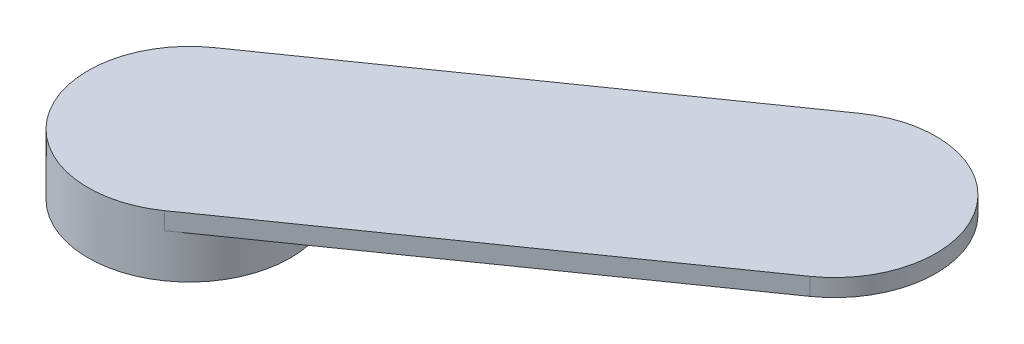
ISO-10303-21;
HEADER;
FILE_DESCRIPTION(('STEP AP214'),'2;1');
FILE_NAME('part.step','',(''),(''),'','','');
FILE_SCHEMA(('AUTOMOTIVE_DESIGN { 1 0 10303 214 1 1 1 1 }'));
ENDSEC;
DATA;
#1=APPLICATION_CONTEXT('core data for automotive mechanical design processes');
#2=APPLICATION_PROTOCOL_DEFINITION('international standard','automotive_design',2000,#1);
#3=PRODUCT_CONTEXT('',#1,'mechanical');
#4=PRODUCT('Part','Part','',(#3));
#5=PRODUCT_RELATED_PRODUCT_CATEGORY('part','',(#4));
#6=PRODUCT_DEFINITION_FORMATION('','',#4);
#7=PRODUCT_DEFINITION_CONTEXT('part definition',#1,'design');
#8=PRODUCT_DEFINITION('design','',#6,#7);
#9=PRODUCT_DEFINITION_SHAPE('','',#8);
#10=(LENGTH_UNIT() NAMED_UNIT(*) SI_UNIT(.MILLI.,.METRE.));
#11=(NAMED_UNIT(*) PLANE_ANGLE_UNIT() SI_UNIT($,.RADIAN.));
#12=(NAMED_UNIT(*) SI_UNIT($,.STERADIAN.) SOLID_ANGLE_UNIT());
#13=UNCERTAINTY_MEASURE_WITH_UNIT(LENGTH_MEASURE(1.E-05),#10,'distance_accuracy_value','');
#14=(GEOMETRIC_REPRESENTATION_CONTEXT(3) GLOBAL_UNCERTAINTY_ASSIGNED_CONTEXT((#13)) GLOBAL_UNIT_ASSIGNED_CONTEXT((#10,
#11,#12)) REPRESENTATION_CONTEXT('',''));
#15=CARTESIAN_POINT('',(0.,0.,0.));
#16=DIRECTION('',(0.,0.,1.));
#17=DIRECTION('',(1.,0.,0.));
#18=AXIS2_PLACEMENT_3D('',#15,#16,#17);
#19=CARTESIAN_POINT('',(0.,-6.,0.));
#20=DIRECTION('',(0.,1.,0.));
#21=DIRECTION('',(0.,0.,1.));
#22=AXIS2_PLACEMENT_3D('',#19,#20,#21);
#23=CYLINDRICAL_SURFACE('',#22,35.);
#24=CARTESIAN_POINT('',(0.,0.,0.));
#25=DIRECTION('',(0.,1.,0.));
#26=DIRECTION('',(0.,0.,1.));
#27=AXIS2_PLACEMENT_3D('',#24,#25,#26);
#28=CIRCLE('',#27,35.);
#29=CARTESIAN_POINT('',(-20.0751752722867,0.,-28.6703215501147));
#30=VERTEX_POINT('',#29);
#31=CARTESIAN_POINT('',(20.0751752722867,0.,28.6703215501147));
#32=VERTEX_POINT('',#31);
#33=EDGE_CURVE('E94',#30,#32,#28,.T.);
#34=ORIENTED_EDGE('',*,*,#33,.F.);
#35=DIRECTION('',(0.,1.,0.));
#36=VECTOR('',#35,1.);
#37=CARTESIAN_POINT('',(-20.0751752722867,-6.,-28.6703215501147));
#38=LINE('',#37,#36);
#39=CARTESIAN_POINT('',(-20.0751752722867,-6.,-28.6703215501147));
#40=VERTEX_POINT('',#39);
#41=EDGE_CURVE('E42',#40,#30,#38,.T.);
#42=ORIENTED_EDGE('',*,*,#41,.F.);
#43=CARTESIAN_POINT('',(0.,-6.,0.));
#44=DIRECTION('',(0.,-1.,0.));
#45=DIRECTION('',(0.,0.,-1.));
#46=AXIS2_PLACEMENT_3D('',#43,#44,#45);
#47=CIRCLE('',#46,35.);
#48=CARTESIAN_POINT('',(20.0751752722867,-6.,28.6703215501147));
#49=VERTEX_POINT('',#48);
#50=EDGE_CURVE('E11',#40,#49,#47,.T.);
#51=ORIENTED_EDGE('',*,*,#50,.T.);
#52=DIRECTION('',(0.,1.,0.));
#53=VECTOR('',#52,1.);
#54=CARTESIAN_POINT('',(20.0751752722867,-6.,28.6703215501147));
#55=LINE('',#54,#53);
#56=EDGE_CURVE('E36',#49,#32,#55,.T.);
#57=ORIENTED_EDGE('',*,*,#56,.T.);
#58=EDGE_LOOP('',(#34,#42,#51,#57));
#59=FACE_BOUND('',#58,.T.);
#60=CARTESIAN_POINT('',(0.,-21.,0.));
#61=DIRECTION('',(0.,-1.,0.));
#62=DIRECTION('',(0.,0.,-1.));
#63=AXIS2_PLACEMENT_3D('',#60,#61,#62);
#64=CIRCLE('',#63,35.);
#65=CARTESIAN_POINT('',(0.,-21.,-35.));
#66=VERTEX_POINT('',#65);
#67=EDGE_CURVE('E101',#66,#66,#64,.T.);
#68=ORIENTED_EDGE('',*,*,#67,.F.);
#69=EDGE_LOOP('',(#68));
#70=FACE_BOUND('',#69,.T.);
#71=ADVANCED_FACE('F33',(#59,#70),#23,.T.);
#72=CARTESIAN_POINT('',(-20.0751752722867,-6.,-28.6703215501147));
#73=DIRECTION('',(0.573576436351047,0.,0.819152044288991));
#74=DIRECTION('',(0.819152044288991,0.,-0.573576436351047));
#75=AXIS2_PLACEMENT_3D('',#72,#73,#74);
#76=PLANE('',#75);
#77=DIRECTION('',(0.819152044288991,0.,-0.573576436351047));
#78=VECTOR('',#77,1.);
#79=CARTESIAN_POINT('',(-20.0751752722867,0.,-28.6703215501147));
#80=LINE('',#79,#78);
#81=CARTESIAN_POINT('',(110.989151813952,0.,-120.442551366282));
#82=VERTEX_POINT('',#81);
#83=EDGE_CURVE('E83',#30,#82,#80,.T.);
#84=ORIENTED_EDGE('',*,*,#83,.T.);
#85=DIRECTION('',(0.,1.,0.));
#86=VECTOR('',#85,1.);
#87=CARTESIAN_POINT('',(110.989151813952,-6.,-120.442551366282));
#88=LINE('',#87,#86);
#89=CARTESIAN_POINT('',(110.989151813952,-6.,-120.442551366282));
#90=VERTEX_POINT('',#89);
#91=EDGE_CURVE('E67',#90,#82,#88,.T.);
#92=ORIENTED_EDGE('',*,*,#91,.F.);
#93=DIRECTION('',(0.819152044288991,0.,-0.573576436351047));
#94=VECTOR('',#93,1.);
#95=CARTESIAN_POINT('',(-20.0751752722867,-6.,-28.6703215501147));
#96=LINE('',#95,#94);
#97=EDGE_CURVE('E92',#40,#90,#96,.T.);
#98=ORIENTED_EDGE('',*,*,#97,.F.);
#99=ORIENTED_EDGE('',*,*,#41,.T.);
#100=EDGE_LOOP('',(#84,#92,#98,#99));
#101=FACE_BOUND('',#100,.T.);
#102=ADVANCED_FACE('F96',(#101),#76,.F.);
#103=CARTESIAN_POINT('',(131.064327086239,-6.,-91.7722298161676));
#104=DIRECTION('',(0.,1.,0.));
#105=DIRECTION('',(0.,0.,1.));
#106=AXIS2_PLACEMENT_3D('',#103,#104,#105);
#107=CYLINDRICAL_SURFACE('',#106,35.);
#108=CARTESIAN_POINT('',(131.064327086239,0.,-91.7722298161676));
#109=DIRECTION('',(0.,1.,0.));
#110=DIRECTION('',(0.,0.,1.));
#111=AXIS2_PLACEMENT_3D('',#108,#109,#110);
#112=CIRCLE('',#111,35.);
#113=CARTESIAN_POINT('',(151.139502358525,0.,-63.1019082660528));
#114=VERTEX_POINT('',#113);
#115=EDGE_CURVE('E103',#114,#82,#112,.T.);
#116=ORIENTED_EDGE('',*,*,#115,.F.);
#117=DIRECTION('',(0.,1.,0.));
#118=VECTOR('',#117,1.);
#119=CARTESIAN_POINT('',(151.139502358525,-6.,-63.1019082660528));
#120=LINE('',#119,#118);
#121=CARTESIAN_POINT('',(151.139502358525,-6.,-63.1019082660528));
#122=VERTEX_POINT('',#121);
#123=EDGE_CURVE('E74',#122,#114,#120,.T.);
#124=ORIENTED_EDGE('',*,*,#123,.F.);
#125=CARTESIAN_POINT('',(131.064327086239,-6.,-91.7722298161676));
#126=DIRECTION('',(0.,1.,0.));
#127=DIRECTION('',(0.,0.,1.));
#128=AXIS2_PLACEMENT_3D('',#125,#126,#127);
#129=CIRCLE('',#128,35.);
#130=EDGE_CURVE('E81',#122,#90,#129,.T.);
#131=ORIENTED_EDGE('',*,*,#130,.T.);
#132=ORIENTED_EDGE('',*,*,#91,.T.);
#133=EDGE_LOOP('',(#116,#124,#131,#132));
#134=FACE_BOUND('',#133,.T.);
#135=ADVANCED_FACE('F107',(#134),#107,.T.);
#136=CARTESIAN_POINT('',(20.0751752722867,-6.,28.6703215501147));
#137=DIRECTION('',(0.573576436351047,0.,0.819152044288991));
#138=DIRECTION('',(0.819152044288991,0.,-0.573576436351047));
#139=AXIS2_PLACEMENT_3D('',#136,#137,#138);
#140=PLANE('',#139);
#141=DIRECTION('',(0.819152044288991,0.,-0.573576436351047));
#142=VECTOR('',#141,1.);
#143=CARTESIAN_POINT('',(20.0751752722867,0.,28.6703215501147));
#144=LINE('',#143,#142);
#145=EDGE_CURVE('E88',#32,#114,#144,.T.);
#146=ORIENTED_EDGE('',*,*,#145,.F.);
#147=ORIENTED_EDGE('',*,*,#56,.F.);
#148=DIRECTION('',(0.819152044288991,0.,-0.573576436351047));
#149=VECTOR('',#148,1.);
#150=CARTESIAN_POINT('',(20.0751752722867,-6.,28.6703215501147));
#151=LINE('',#150,#149);
#152=EDGE_CURVE('E78',#49,#122,#151,.T.);
#153=ORIENTED_EDGE('',*,*,#152,.T.);
#154=ORIENTED_EDGE('',*,*,#123,.T.);
#155=EDGE_LOOP('',(#146,#147,#153,#154));
#156=FACE_BOUND('',#155,.T.);
#157=ADVANCED_FACE('F86',(#156),#140,.T.);
#158=CARTESIAN_POINT('',(0.,-6.,0.));
#159=DIRECTION('',(0.,1.,0.));
#160=DIRECTION('',(0.,0.,1.));
#161=AXIS2_PLACEMENT_3D('',#158,#159,#160);
#162=PLANE('',#161);
#163=ORIENTED_EDGE('',*,*,#50,.F.);
#164=ORIENTED_EDGE('',*,*,#97,.T.);
#165=ORIENTED_EDGE('',*,*,#130,.F.);
#166=ORIENTED_EDGE('',*,*,#152,.F.);
#167=EDGE_LOOP('',(#163,#164,#165,#166));
#168=FACE_BOUND('',#167,.T.);
#169=ADVANCED_FACE('F80',(#168),#162,.F.);
#170=CARTESIAN_POINT('',(0.,0.,0.));
#171=DIRECTION('',(0.,1.,0.));
#172=DIRECTION('',(0.,0.,1.));
#173=AXIS2_PLACEMENT_3D('',#170,#171,#172);
#174=PLANE('',#173);
#175=ORIENTED_EDGE('',*,*,#33,.T.);
#176=ORIENTED_EDGE('',*,*,#145,.T.);
#177=ORIENTED_EDGE('',*,*,#115,.T.);
#178=ORIENTED_EDGE('',*,*,#83,.F.);
#179=EDGE_LOOP('',(#175,#176,#177,#178));
#180=FACE_BOUND('',#179,.T.);
#181=ADVANCED_FACE('F109',(#180),#174,.T.);
#182=CARTESIAN_POINT('',(0.,-21.,0.));
#183=DIRECTION('',(0.,-1.,0.));
#184=DIRECTION('',(0.,0.,-1.));
#185=AXIS2_PLACEMENT_3D('',#182,#183,#184);
#186=PLANE('',#185);
#187=ORIENTED_EDGE('',*,*,#67,.T.);
#188=EDGE_LOOP('',(#187));
#189=FACE_BOUND('',#188,.T.);
#190=ADVANCED_FACE('F111',(#189),#186,.T.);
#191=CLOSED_SHELL('',(#71,#102,#135,#157,#169,#181,#190));
#192=MANIFOLD_SOLID_BREP('B2',#191);
#193=ADVANCED_BREP_SHAPE_REPRESENTATION('',(#18,#192),#14);
#194=SHAPE_DEFINITION_REPRESENTATION(#9,#193);
ENDSEC;
END-ISO-10303-21;
